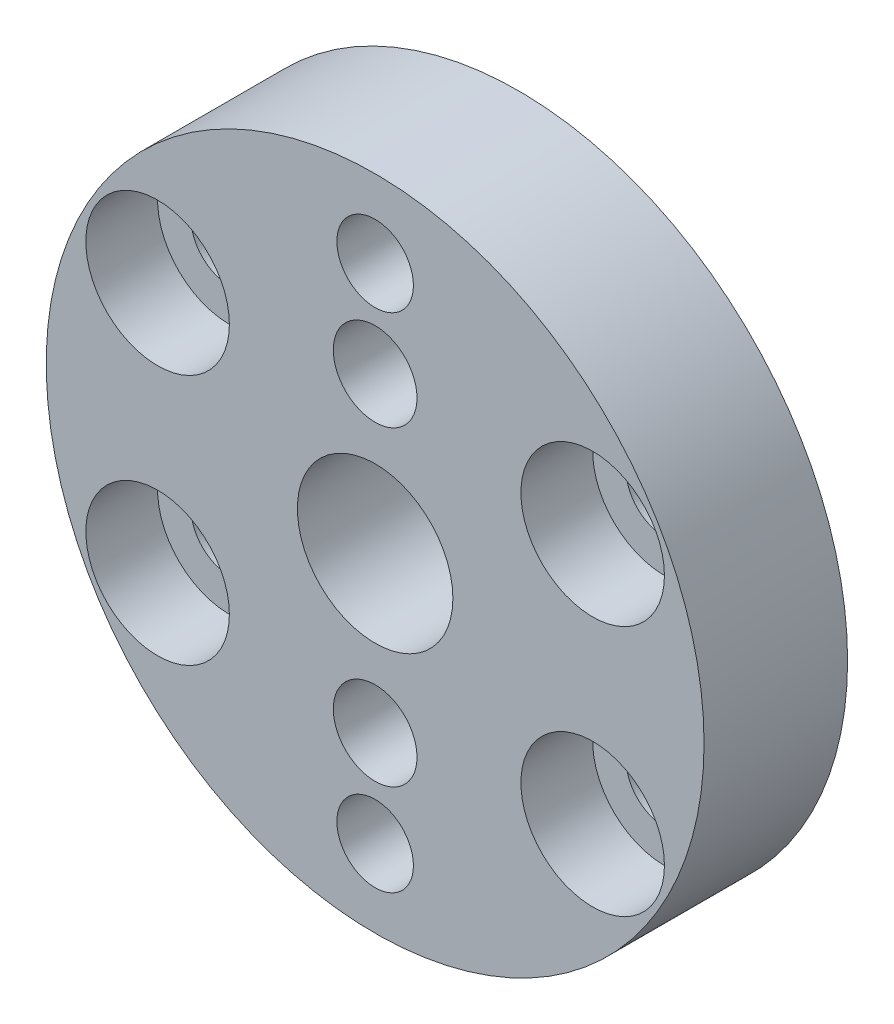
ISO-10303-21;
HEADER;
FILE_DESCRIPTION(('STEP AP214'),'2;1');
FILE_NAME('part.step','',(''),(''),'','','');
FILE_SCHEMA(('AUTOMOTIVE_DESIGN { 1 0 10303 214 1 1 1 1 }'));
ENDSEC;
DATA;
#1=APPLICATION_CONTEXT('core data for automotive mechanical design processes');
#2=APPLICATION_PROTOCOL_DEFINITION('international standard','automotive_design',2000,#1);
#3=PRODUCT_CONTEXT('',#1,'mechanical');
#4=PRODUCT('Part','Part','',(#3));
#5=PRODUCT_RELATED_PRODUCT_CATEGORY('part','',(#4));
#6=PRODUCT_DEFINITION_FORMATION('','',#4);
#7=PRODUCT_DEFINITION_CONTEXT('part definition',#1,'design');
#8=PRODUCT_DEFINITION('design','',#6,#7);
#9=PRODUCT_DEFINITION_SHAPE('','',#8);
#10=(LENGTH_UNIT() NAMED_UNIT(*) SI_UNIT(.MILLI.,.METRE.));
#11=(NAMED_UNIT(*) PLANE_ANGLE_UNIT() SI_UNIT($,.RADIAN.));
#12=(NAMED_UNIT(*) SI_UNIT($,.STERADIAN.) SOLID_ANGLE_UNIT());
#13=UNCERTAINTY_MEASURE_WITH_UNIT(LENGTH_MEASURE(1.E-05),#10,'distance_accuracy_value','');
#14=(GEOMETRIC_REPRESENTATION_CONTEXT(3) GLOBAL_UNCERTAINTY_ASSIGNED_CONTEXT((#13)) GLOBAL_UNIT_ASSIGNED_CONTEXT((#10,
#11,#12)) REPRESENTATION_CONTEXT('',''));
#15=CARTESIAN_POINT('',(0.,0.,0.));
#16=DIRECTION('',(0.,0.,1.));
#17=DIRECTION('',(1.,0.,0.));
#18=AXIS2_PLACEMENT_3D('',#15,#16,#17);
#19=CARTESIAN_POINT('',(-1.39645239816133E-13,-6.49999999999982,0.));
#20=DIRECTION('',(0.,0.,1.));
#21=DIRECTION('',(1.,0.,0.));
#22=AXIS2_PLACEMENT_3D('',#19,#20,#21);
#23=CYLINDRICAL_SURFACE('',#22,1.75);
#24=CARTESIAN_POINT('',(-1.39645239816133E-13,-6.49999999999982,6.));
#25=DIRECTION('',(0.,0.,1.));
#26=DIRECTION('',(1.,0.,0.));
#27=AXIS2_PLACEMENT_3D('',#24,#25,#26);
#28=CIRCLE('',#27,1.75);
#29=CARTESIAN_POINT('',(1.74999999999986,-6.49999999999982,6.));
#30=VERTEX_POINT('',#29);
#31=EDGE_CURVE('E333',#30,#30,#28,.T.);
#32=ORIENTED_EDGE('',*,*,#31,.T.);
#33=EDGE_LOOP('',(#32));
#34=FACE_BOUND('',#33,.T.);
#35=CARTESIAN_POINT('',(-1.39645239816133E-13,-6.49999999999982,3.));
#36=DIRECTION('',(0.,0.,-1.));
#37=DIRECTION('',(-1.,0.,0.));
#38=AXIS2_PLACEMENT_3D('',#35,#36,#37);
#39=CIRCLE('',#38,1.75);
#40=CARTESIAN_POINT('',(-1.75000000000014,-6.49999999999982,3.));
#41=VERTEX_POINT('',#40);
#42=EDGE_CURVE('E290',#41,#41,#39,.F.);
#43=ORIENTED_EDGE('',*,*,#42,.F.);
#44=EDGE_LOOP('',(#43));
#45=FACE_BOUND('',#44,.T.);
#46=ADVANCED_FACE('F43',(#34,#45),#23,.F.);
#47=CARTESIAN_POINT('',(0.,6.5,0.));
#48=DIRECTION('',(0.,0.,1.));
#49=DIRECTION('',(1.,0.,0.));
#50=AXIS2_PLACEMENT_3D('',#47,#48,#49);
#51=CYLINDRICAL_SURFACE('',#50,1.75);
#52=CARTESIAN_POINT('',(0.,6.5,6.));
#53=DIRECTION('',(0.,0.,1.));
#54=DIRECTION('',(1.,0.,0.));
#55=AXIS2_PLACEMENT_3D('',#52,#53,#54);
#56=CIRCLE('',#55,1.75);
#57=CARTESIAN_POINT('',(1.75000000000004,6.5,6.));
#58=VERTEX_POINT('',#57);
#59=EDGE_CURVE('E328',#58,#58,#56,.T.);
#60=ORIENTED_EDGE('',*,*,#59,.T.);
#61=EDGE_LOOP('',(#60));
#62=FACE_BOUND('',#61,.T.);
#63=CARTESIAN_POINT('',(0.,6.5,3.));
#64=DIRECTION('',(0.,0.,-1.));
#65=DIRECTION('',(-1.,0.,0.));
#66=AXIS2_PLACEMENT_3D('',#63,#64,#65);
#67=CIRCLE('',#66,1.75);
#68=CARTESIAN_POINT('',(-1.74999999999996,6.5,3.));
#69=VERTEX_POINT('',#68);
#70=EDGE_CURVE('E216',#69,#69,#67,.F.);
#71=ORIENTED_EDGE('',*,*,#70,.F.);
#72=EDGE_LOOP('',(#71));
#73=FACE_BOUND('',#72,.T.);
#74=ADVANCED_FACE('F449',(#62,#73),#51,.F.);
#75=CARTESIAN_POINT('',(9.09326673973672,5.2500000000002,6.));
#76=DIRECTION('',(0.,0.,-1.));
#77=DIRECTION('',(-1.,0.,0.));
#78=AXIS2_PLACEMENT_3D('',#75,#76,#77);
#79=CYLINDRICAL_SURFACE('',#78,1.6);
#80=CARTESIAN_POINT('',(9.09326673973672,5.2500000000002,0.));
#81=DIRECTION('',(0.,0.,1.));
#82=DIRECTION('',(1.,0.,0.));
#83=AXIS2_PLACEMENT_3D('',#80,#81,#82);
#84=CIRCLE('',#83,1.6);
#85=CARTESIAN_POINT('',(10.6932667397367,5.2500000000002,0.));
#86=VERTEX_POINT('',#85);
#87=EDGE_CURVE('E357',#86,#86,#84,.T.);
#88=ORIENTED_EDGE('',*,*,#87,.F.);
#89=EDGE_LOOP('',(#88));
#90=FACE_BOUND('',#89,.T.);
#91=CARTESIAN_POINT('',(9.09326673973672,5.2500000000002,3.));
#92=DIRECTION('',(0.,0.,1.));
#93=DIRECTION('',(1.,0.,0.));
#94=AXIS2_PLACEMENT_3D('',#91,#92,#93);
#95=CIRCLE('',#94,1.6);
#96=CARTESIAN_POINT('',(10.6932667397367,5.2500000000002,3.));
#97=VERTEX_POINT('',#96);
#98=EDGE_CURVE('E337',#97,#97,#95,.T.);
#99=ORIENTED_EDGE('',*,*,#98,.T.);
#100=EDGE_LOOP('',(#99));
#101=FACE_BOUND('',#100,.T.);
#102=ADVANCED_FACE('F455',(#90,#101),#79,.F.);
#103=CARTESIAN_POINT('',(9.09326673973694,-5.24999999999981,6.));
#104=DIRECTION('',(0.,0.,-1.));
#105=DIRECTION('',(-1.,0.,0.));
#106=AXIS2_PLACEMENT_3D('',#103,#104,#105);
#107=CYLINDRICAL_SURFACE('',#106,1.6);
#108=CARTESIAN_POINT('',(9.09326673973694,-5.24999999999981,0.));
#109=DIRECTION('',(0.,0.,1.));
#110=DIRECTION('',(1.,0.,0.));
#111=AXIS2_PLACEMENT_3D('',#108,#109,#110);
#112=CIRCLE('',#111,1.6);
#113=CARTESIAN_POINT('',(10.6932667397369,-5.24999999999981,0.));
#114=VERTEX_POINT('',#113);
#115=EDGE_CURVE('E350',#114,#114,#112,.T.);
#116=ORIENTED_EDGE('',*,*,#115,.F.);
#117=EDGE_LOOP('',(#116));
#118=FACE_BOUND('',#117,.T.);
#119=CARTESIAN_POINT('',(9.09326673973694,-5.24999999999981,3.));
#120=DIRECTION('',(0.,0.,1.));
#121=DIRECTION('',(1.,0.,0.));
#122=AXIS2_PLACEMENT_3D('',#119,#120,#121);
#123=CIRCLE('',#122,1.6);
#124=CARTESIAN_POINT('',(10.6932667397369,-5.24999999999981,3.));
#125=VERTEX_POINT('',#124);
#126=EDGE_CURVE('E393',#125,#125,#123,.T.);
#127=ORIENTED_EDGE('',*,*,#126,.T.);
#128=EDGE_LOOP('',(#127));
#129=FACE_BOUND('',#128,.T.);
#130=ADVANCED_FACE('F469',(#118,#129),#107,.F.);
#131=CARTESIAN_POINT('',(-9.09326673973627,-5.2500000000002,6.));
#132=DIRECTION('',(0.,0.,-1.));
#133=DIRECTION('',(-1.,0.,0.));
#134=AXIS2_PLACEMENT_3D('',#131,#132,#133);
#135=CYLINDRICAL_SURFACE('',#134,1.6);
#136=CARTESIAN_POINT('',(-9.09326673973627,-5.2500000000002,0.));
#137=DIRECTION('',(0.,0.,1.));
#138=DIRECTION('',(1.,0.,0.));
#139=AXIS2_PLACEMENT_3D('',#136,#137,#138);
#140=CIRCLE('',#139,1.6);
#141=CARTESIAN_POINT('',(-7.49326673973627,-5.2500000000002,0.));
#142=VERTEX_POINT('',#141);
#143=EDGE_CURVE('E341',#142,#142,#140,.T.);
#144=ORIENTED_EDGE('',*,*,#143,.F.);
#145=EDGE_LOOP('',(#144));
#146=FACE_BOUND('',#145,.T.);
#147=CARTESIAN_POINT('',(-9.09326673973627,-5.2500000000002,3.));
#148=DIRECTION('',(0.,0.,1.));
#149=DIRECTION('',(1.,0.,0.));
#150=AXIS2_PLACEMENT_3D('',#147,#148,#149);
#151=CIRCLE('',#150,1.6);
#152=CARTESIAN_POINT('',(-7.49326673973627,-5.2500000000002,3.));
#153=VERTEX_POINT('',#152);
#154=EDGE_CURVE('E389',#153,#153,#151,.T.);
#155=ORIENTED_EDGE('',*,*,#154,.T.);
#156=EDGE_LOOP('',(#155));
#157=FACE_BOUND('',#156,.T.);
#158=ADVANCED_FACE('F465',(#146,#157),#135,.F.);
#159=CARTESIAN_POINT('',(-9.0932667397365,5.2499999999998,6.));
#160=DIRECTION('',(0.,0.,-1.));
#161=DIRECTION('',(-1.,0.,0.));
#162=AXIS2_PLACEMENT_3D('',#159,#160,#161);
#163=CYLINDRICAL_SURFACE('',#162,1.6);
#164=CARTESIAN_POINT('',(-9.0932667397365,5.2499999999998,0.));
#165=DIRECTION('',(0.,0.,1.));
#166=DIRECTION('',(1.,0.,0.));
#167=AXIS2_PLACEMENT_3D('',#164,#165,#166);
#168=CIRCLE('',#167,1.6);
#169=CARTESIAN_POINT('',(-7.4932667397365,5.2499999999998,0.));
#170=VERTEX_POINT('',#169);
#171=EDGE_CURVE('E332',#170,#170,#168,.T.);
#172=ORIENTED_EDGE('',*,*,#171,.F.);
#173=EDGE_LOOP('',(#172));
#174=FACE_BOUND('',#173,.T.);
#175=CARTESIAN_POINT('',(-9.0932667397365,5.2499999999998,3.));
#176=DIRECTION('',(0.,0.,1.));
#177=DIRECTION('',(1.,0.,0.));
#178=AXIS2_PLACEMENT_3D('',#175,#176,#177);
#179=CIRCLE('',#178,1.6);
#180=CARTESIAN_POINT('',(-7.4932667397365,5.2499999999998,3.));
#181=VERTEX_POINT('',#180);
#182=EDGE_CURVE('E324',#181,#181,#179,.T.);
#183=ORIENTED_EDGE('',*,*,#182,.T.);
#184=EDGE_LOOP('',(#183));
#185=FACE_BOUND('',#184,.T.);
#186=ADVANCED_FACE('F461',(#174,#185),#163,.F.);
#187=CARTESIAN_POINT('',(0.,0.,6.));
#188=DIRECTION('',(0.,0.,1.));
#189=DIRECTION('',(1.,0.,0.));
#190=AXIS2_PLACEMENT_3D('',#187,#188,#189);
#191=PLANE('',#190);
#192=CARTESIAN_POINT('',(9.09326673973694,-5.24999999999981,6.));
#193=DIRECTION('',(0.,0.,1.));
#194=DIRECTION('',(1.,0.,0.));
#195=AXIS2_PLACEMENT_3D('',#192,#193,#194);
#196=CIRCLE('',#195,3.);
#197=CARTESIAN_POINT('',(12.0932667397369,-5.24999999999981,6.));
#198=VERTEX_POINT('',#197);
#199=EDGE_CURVE('E313',#198,#198,#196,.T.);
#200=ORIENTED_EDGE('',*,*,#199,.F.);
#201=EDGE_LOOP('',(#200));
#202=FACE_BOUND('',#201,.T.);
#203=CARTESIAN_POINT('',(-9.0932667397365,5.2499999999998,6.));
#204=DIRECTION('',(0.,0.,1.));
#205=DIRECTION('',(1.,0.,0.));
#206=AXIS2_PLACEMENT_3D('',#203,#204,#205);
#207=CIRCLE('',#206,3.);
#208=CARTESIAN_POINT('',(-6.0932667397365,5.2499999999998,6.));
#209=VERTEX_POINT('',#208);
#210=EDGE_CURVE('E305',#209,#209,#207,.T.);
#211=ORIENTED_EDGE('',*,*,#210,.F.);
#212=EDGE_LOOP('',(#211));
#213=FACE_BOUND('',#212,.T.);
#214=CARTESIAN_POINT('',(-9.09326673973627,-5.2500000000002,6.));
#215=DIRECTION('',(0.,0.,1.));
#216=DIRECTION('',(1.,0.,0.));
#217=AXIS2_PLACEMENT_3D('',#214,#215,#216);
#218=CIRCLE('',#217,3.);
#219=CARTESIAN_POINT('',(-6.09326673973627,-5.2500000000002,6.));
#220=VERTEX_POINT('',#219);
#221=EDGE_CURVE('E296',#220,#220,#218,.T.);
#222=ORIENTED_EDGE('',*,*,#221,.F.);
#223=EDGE_LOOP('',(#222));
#224=FACE_BOUND('',#223,.T.);
#225=CARTESIAN_POINT('',(9.09326673973672,5.2500000000002,6.));
#226=DIRECTION('',(0.,0.,1.));
#227=DIRECTION('',(1.,0.,0.));
#228=AXIS2_PLACEMENT_3D('',#225,#226,#227);
#229=CIRCLE('',#228,3.);
#230=CARTESIAN_POINT('',(12.0932667397367,5.2500000000002,6.));
#231=VERTEX_POINT('',#230);
#232=EDGE_CURVE('E300',#231,#231,#229,.T.);
#233=ORIENTED_EDGE('',*,*,#232,.F.);
#234=EDGE_LOOP('',(#233));
#235=FACE_BOUND('',#234,.T.);
#236=ORIENTED_EDGE('',*,*,#59,.F.);
#237=EDGE_LOOP('',(#236));
#238=FACE_BOUND('',#237,.T.);
#239=ORIENTED_EDGE('',*,*,#31,.F.);
#240=EDGE_LOOP('',(#239));
#241=FACE_BOUND('',#240,.T.);
#242=CARTESIAN_POINT('',(0.,0.,6.));
#243=DIRECTION('',(0.,0.,1.));
#244=DIRECTION('',(1.,0.,0.));
#245=AXIS2_PLACEMENT_3D('',#242,#243,#244);
#246=CIRCLE('',#245,3.25);
#247=CARTESIAN_POINT('',(3.25,0.,6.));
#248=VERTEX_POINT('',#247);
#249=EDGE_CURVE('E362',#248,#248,#246,.T.);
#250=ORIENTED_EDGE('',*,*,#249,.F.);
#251=EDGE_LOOP('',(#250));
#252=FACE_BOUND('',#251,.T.);
#253=CARTESIAN_POINT('',(0.,0.,6.));
#254=DIRECTION('',(0.,0.,1.));
#255=DIRECTION('',(1.,0.,0.));
#256=AXIS2_PLACEMENT_3D('',#253,#254,#255);
#257=CIRCLE('',#256,13.75);
#258=CARTESIAN_POINT('',(13.75,0.,6.));
#259=VERTEX_POINT('',#258);
#260=EDGE_CURVE('E378',#259,#259,#257,.T.);
#261=ORIENTED_EDGE('',*,*,#260,.T.);
#262=EDGE_LOOP('',(#261));
#263=FACE_BOUND('',#262,.T.);
#264=CARTESIAN_POINT('',(0.,10.5,6.));
#265=DIRECTION('',(0.,0.,1.));
#266=DIRECTION('',(1.,0.,0.));
#267=AXIS2_PLACEMENT_3D('',#264,#265,#266);
#268=CIRCLE('',#267,1.6);
#269=CARTESIAN_POINT('',(1.6,10.5,6.));
#270=VERTEX_POINT('',#269);
#271=EDGE_CURVE('E370',#270,#270,#268,.T.);
#272=ORIENTED_EDGE('',*,*,#271,.F.);
#273=EDGE_LOOP('',(#272));
#274=FACE_BOUND('',#273,.T.);
#275=CARTESIAN_POINT('',(4.46356044389758E-13,-10.5,6.));
#276=DIRECTION('',(0.,0.,1.));
#277=DIRECTION('',(1.,0.,0.));
#278=AXIS2_PLACEMENT_3D('',#275,#276,#277);
#279=CIRCLE('',#278,1.6);
#280=CARTESIAN_POINT('',(1.60000000000045,-10.5,6.));
#281=VERTEX_POINT('',#280);
#282=EDGE_CURVE('E346',#281,#281,#279,.T.);
#283=ORIENTED_EDGE('',*,*,#282,.F.);
#284=EDGE_LOOP('',(#283));
#285=FACE_BOUND('',#284,.T.);
#286=ADVANCED_FACE('F464',(#202,#213,#224,#235,#238,#241,#252,#263,#274,#285),#191,.T.);
#287=CARTESIAN_POINT('',(0.,0.,0.));
#288=DIRECTION('',(0.,0.,1.));
#289=DIRECTION('',(1.,0.,0.));
#290=AXIS2_PLACEMENT_3D('',#287,#288,#289);
#291=PLANE('',#290);
#292=CARTESIAN_POINT('',(0.,0.,0.));
#293=DIRECTION('',(0.,0.,1.));
#294=DIRECTION('',(1.,0.,0.));
#295=AXIS2_PLACEMENT_3D('',#292,#293,#294);
#296=CIRCLE('',#295,13.75);
#297=CARTESIAN_POINT('',(13.75,0.,0.));
#298=VERTEX_POINT('',#297);
#299=EDGE_CURVE('E374',#298,#298,#296,.T.);
#300=ORIENTED_EDGE('',*,*,#299,.F.);
#301=EDGE_LOOP('',(#300));
#302=FACE_BOUND('',#301,.T.);
#303=DIRECTION('',(0.494012576307102,-0.869454756988781,0.));
#304=VECTOR('',#303,1.);
#305=CARTESIAN_POINT('',(1.75270938922449,9.48797754290832,0.));
#306=LINE('',#305,#304);
#307=CARTESIAN_POINT('',(1.75270938922449,9.48797754290832,0.));
#308=VERTEX_POINT('',#307);
#309=CARTESIAN_POINT('',(3.46401915270828,6.47609791493428,0.));
#310=VERTEX_POINT('',#309);
#311=EDGE_CURVE('E183',#308,#310,#306,.T.);
#312=ORIENTED_EDGE('',*,*,#311,.F.);
#313=DIRECTION('',(0.999976195147061,-0.0068999376234412,0.));
#314=VECTOR('',#313,1.);
#315=CARTESIAN_POINT('',(-1.71130976348375,9.51187962797404,0.));
#316=LINE('',#315,#314);
#317=CARTESIAN_POINT('',(1.24214681558494,9.49150047668222,0.));
#318=VERTEX_POINT('',#317);
#319=EDGE_CURVE('E206',#318,#308,#316,.T.);
#320=ORIENTED_EDGE('',*,*,#319,.F.);
#321=CARTESIAN_POINT('',(0.,10.5,0.));
#322=DIRECTION('',(0.,0.,1.));
#323=DIRECTION('',(1.,0.,0.));
#324=AXIS2_PLACEMENT_3D('',#321,#322,#323);
#325=CIRCLE('',#324,1.6);
#326=CARTESIAN_POINT('',(-1.25594537681582,9.5087375673138,0.));
#327=VERTEX_POINT('',#326);
#328=EDGE_CURVE('E366',#318,#327,#325,.T.);
#329=ORIENTED_EDGE('',*,*,#328,.T.);
#330=CARTESIAN_POINT('',(-1.71130976348375,9.51187962797404,0.));
#331=VERTEX_POINT('',#330);
#332=EDGE_CURVE('E207',#331,#327,#316,.T.);
#333=ORIENTED_EDGE('',*,*,#332,.F.);
#334=DIRECTION('',(0.505963618839959,0.862554819365339,0.));
#335=VECTOR('',#334,1.);
#336=CARTESIAN_POINT('',(-3.46401915270819,6.52390208506571,0.));
#337=LINE('',#336,#335);
#338=CARTESIAN_POINT('',(-3.46401915270819,6.52390208506571,0.));
#339=VERTEX_POINT('',#338);
#340=EDGE_CURVE('E202',#339,#331,#337,.T.);
#341=ORIENTED_EDGE('',*,*,#340,.F.);
#342=DIRECTION('',(-0.494012576307102,0.869454756988781,0.));
#343=VECTOR('',#342,1.);
#344=CARTESIAN_POINT('',(-1.7527093892244,3.51202245709167,0.));
#345=LINE('',#344,#343);
#346=CARTESIAN_POINT('',(-1.7527093892244,3.51202245709167,0.));
#347=VERTEX_POINT('',#346);
#348=EDGE_CURVE('E198',#347,#339,#345,.T.);
#349=ORIENTED_EDGE('',*,*,#348,.F.);
#350=DIRECTION('',(-0.999976195147061,0.00689993762344183,0.));
#351=VECTOR('',#350,1.);
#352=CARTESIAN_POINT('',(1.71130976348384,3.48812037202596,0.));
#353=LINE('',#352,#351);
#354=CARTESIAN_POINT('',(1.71130976348384,3.48812037202596,0.));
#355=VERTEX_POINT('',#354);
#356=EDGE_CURVE('E159',#355,#347,#353,.T.);
#357=ORIENTED_EDGE('',*,*,#356,.F.);
#358=DIRECTION('',(-0.505963618839959,-0.862554819365339,0.));
#359=VECTOR('',#358,1.);
#360=CARTESIAN_POINT('',(3.46401915270828,6.47609791493428,0.));
#361=LINE('',#360,#359);
#362=EDGE_CURVE('E179',#310,#355,#361,.T.);
#363=ORIENTED_EDGE('',*,*,#362,.F.);
#364=EDGE_LOOP('',(#312,#320,#329,#333,#341,#349,#357,#363));
#365=FACE_BOUND('',#364,.T.);
#366=CARTESIAN_POINT('',(0.,0.,0.));
#367=DIRECTION('',(0.,0.,1.));
#368=DIRECTION('',(1.,0.,0.));
#369=AXIS2_PLACEMENT_3D('',#366,#367,#368);
#370=CIRCLE('',#369,3.25);
#371=CARTESIAN_POINT('',(3.25,0.,0.));
#372=VERTEX_POINT('',#371);
#373=EDGE_CURVE('E361',#372,#372,#370,.T.);
#374=ORIENTED_EDGE('',*,*,#373,.T.);
#375=EDGE_LOOP('',(#374));
#376=FACE_BOUND('',#375,.T.);
#377=ORIENTED_EDGE('',*,*,#87,.T.);
#378=EDGE_LOOP('',(#377));
#379=FACE_BOUND('',#378,.T.);
#380=ORIENTED_EDGE('',*,*,#115,.T.);
#381=EDGE_LOOP('',(#380));
#382=FACE_BOUND('',#381,.T.);
#383=DIRECTION('',(-0.302406249280172,0.953179133424719,0.));
#384=VECTOR('',#383,1.);
#385=CARTESIAN_POINT('',(-2.3357544119947,-9.05817343564642,0.));
#386=LINE('',#385,#384);
#387=CARTESIAN_POINT('',(-2.3357544119947,-9.05817343564642,0.));
#388=VERTEX_POINT('',#387);
#389=CARTESIAN_POINT('',(-3.38332038855389,-5.75626406003425,0.));
#390=VERTEX_POINT('',#389);
#391=EDGE_CURVE('E261',#388,#390,#386,.T.);
#392=ORIENTED_EDGE('',*,*,#391,.F.);
#393=DIRECTION('',(-0.97668046854313,0.214698072572561,0.));
#394=VECTOR('',#393,1.);
#395=CARTESIAN_POINT('',(1.04756597655906,-9.80190937561199,0.));
#396=LINE('',#395,#394);
#397=CARTESIAN_POINT('',(-1.09286440165038,-9.33139082683543,0.));
#398=VERTEX_POINT('',#397);
#399=EDGE_CURVE('E199',#398,#388,#396,.T.);
#400=ORIENTED_EDGE('',*,*,#399,.F.);
#401=CARTESIAN_POINT('',(4.46356044389758E-13,-10.5,0.));
#402=DIRECTION('',(0.,0.,1.));
#403=DIRECTION('',(1.,0.,0.));
#404=AXIS2_PLACEMENT_3D('',#401,#402,#403);
#405=CIRCLE('',#404,1.6);
#406=CARTESIAN_POINT('',(1.28301780376739,-9.54403696974357,0.));
#407=VERTEX_POINT('',#406);
#408=EDGE_CURVE('E345',#398,#407,#405,.T.);
#409=ORIENTED_EDGE('',*,*,#408,.T.);
#410=DIRECTION('',(-0.674274219262957,-0.738481060852158,0.));
#411=VECTOR('',#410,1.);
#412=CARTESIAN_POINT('',(3.38332038855361,-7.24373593996539,0.));
#413=LINE('',#412,#411);
#414=CARTESIAN_POINT('',(3.38332038855361,-7.24373593996539,0.));
#415=VERTEX_POINT('',#414);
#416=EDGE_CURVE('E245',#415,#407,#413,.T.);
#417=ORIENTED_EDGE('',*,*,#416,.F.);
#418=DIRECTION('',(0.302406249280172,-0.953179133424719,0.));
#419=VECTOR('',#418,1.);
#420=CARTESIAN_POINT('',(2.33575441199442,-3.94182656435321,0.));
#421=LINE('',#420,#419);
#422=CARTESIAN_POINT('',(2.33575441199442,-3.94182656435321,0.));
#423=VERTEX_POINT('',#422);
#424=EDGE_CURVE('E248',#423,#415,#421,.T.);
#425=ORIENTED_EDGE('',*,*,#424,.F.);
#426=DIRECTION('',(0.97668046854313,-0.214698072572561,0.));
#427=VECTOR('',#426,1.);
#428=CARTESIAN_POINT('',(-1.04756597655933,-3.19809062438764,0.));
#429=LINE('',#428,#427);
#430=CARTESIAN_POINT('',(-1.04756597655933,-3.19809062438764,0.));
#431=VERTEX_POINT('',#430);
#432=EDGE_CURVE('E253',#431,#423,#429,.T.);
#433=ORIENTED_EDGE('',*,*,#432,.F.);
#434=DIRECTION('',(0.674274219262958,0.738481060852158,0.));
#435=VECTOR('',#434,1.);
#436=CARTESIAN_POINT('',(-3.38332038855389,-5.75626406003425,0.));
#437=LINE('',#436,#435);
#438=EDGE_CURVE('E257',#390,#431,#437,.T.);
#439=ORIENTED_EDGE('',*,*,#438,.F.);
#440=EDGE_LOOP('',(#392,#400,#409,#417,#425,#433,#439));
#441=FACE_BOUND('',#440,.T.);
#442=ORIENTED_EDGE('',*,*,#143,.T.);
#443=EDGE_LOOP('',(#442));
#444=FACE_BOUND('',#443,.T.);
#445=ORIENTED_EDGE('',*,*,#171,.T.);
#446=EDGE_LOOP('',(#445));
#447=FACE_BOUND('',#446,.T.);
#448=ADVANCED_FACE('F434',(#302,#365,#376,#379,#382,#441,#444,#447),#291,.F.);
#449=CARTESIAN_POINT('',(0.,0.,6.));
#450=DIRECTION('',(0.,0.,-1.));
#451=DIRECTION('',(-1.,0.,0.));
#452=AXIS2_PLACEMENT_3D('',#449,#450,#451);
#453=CYLINDRICAL_SURFACE('',#452,13.75);
#454=ORIENTED_EDGE('',*,*,#260,.F.);
#455=EDGE_LOOP('',(#454));
#456=FACE_BOUND('',#455,.T.);
#457=ORIENTED_EDGE('',*,*,#299,.T.);
#458=EDGE_LOOP('',(#457));
#459=FACE_BOUND('',#458,.T.);
#460=ADVANCED_FACE('F45',(#456,#459),#453,.T.);
#461=CARTESIAN_POINT('',(0.,10.5,6.));
#462=DIRECTION('',(0.,0.,-1.));
#463=DIRECTION('',(-1.,0.,0.));
#464=AXIS2_PLACEMENT_3D('',#461,#462,#463);
#465=CYLINDRICAL_SURFACE('',#464,1.6);
#466=DIRECTION('',(0.,0.,-1.));
#467=VECTOR('',#466,1.);
#468=CARTESIAN_POINT('',(1.24214681558494,9.49150047668222,6.));
#469=LINE('',#468,#467);
#470=CARTESIAN_POINT('',(1.24214681558494,9.49150047668222,3.));
#471=VERTEX_POINT('',#470);
#472=EDGE_CURVE('E11',#471,#318,#469,.T.);
#473=ORIENTED_EDGE('',*,*,#472,.F.);
#474=CARTESIAN_POINT('',(0.,10.5,3.));
#475=DIRECTION('',(0.,0.,-1.));
#476=DIRECTION('',(-1.,0.,0.));
#477=AXIS2_PLACEMENT_3D('',#474,#475,#476);
#478=CIRCLE('',#477,1.6);
#479=CARTESIAN_POINT('',(-1.25594537681582,9.5087375673138,3.));
#480=VERTEX_POINT('',#479);
#481=EDGE_CURVE('E286',#471,#480,#478,.T.);
#482=ORIENTED_EDGE('',*,*,#481,.T.);
#483=DIRECTION('',(0.,0.,-1.));
#484=VECTOR('',#483,1.);
#485=CARTESIAN_POINT('',(-1.25594537681582,9.5087375673138,6.));
#486=LINE('',#485,#484);
#487=EDGE_CURVE('E52',#327,#480,#486,.F.);
#488=ORIENTED_EDGE('',*,*,#487,.F.);
#489=ORIENTED_EDGE('',*,*,#328,.F.);
#490=EDGE_LOOP('',(#473,#482,#488,#489));
#491=FACE_BOUND('',#490,.T.);
#492=ORIENTED_EDGE('',*,*,#271,.T.);
#493=EDGE_LOOP('',(#492));
#494=FACE_BOUND('',#493,.T.);
#495=ADVANCED_FACE('F418',(#491,#494),#465,.F.);
#496=CARTESIAN_POINT('',(0.,0.,6.));
#497=DIRECTION('',(0.,0.,-1.));
#498=DIRECTION('',(-1.,0.,0.));
#499=AXIS2_PLACEMENT_3D('',#496,#497,#498);
#500=CYLINDRICAL_SURFACE('',#499,3.25);
#501=ORIENTED_EDGE('',*,*,#249,.T.);
#502=EDGE_LOOP('',(#501));
#503=FACE_BOUND('',#502,.T.);
#504=ORIENTED_EDGE('',*,*,#373,.F.);
#505=EDGE_LOOP('',(#504));
#506=FACE_BOUND('',#505,.T.);
#507=ADVANCED_FACE('F475',(#503,#506),#500,.F.);
#508=CARTESIAN_POINT('',(4.46356044389758E-13,-10.5,6.));
#509=DIRECTION('',(0.,0.,-1.));
#510=DIRECTION('',(-1.,0.,0.));
#511=AXIS2_PLACEMENT_3D('',#508,#509,#510);
#512=CYLINDRICAL_SURFACE('',#511,1.6);
#513=DIRECTION('',(0.,0.,-1.));
#514=VECTOR('',#513,1.);
#515=CARTESIAN_POINT('',(-1.09286440165038,-9.33139082683543,6.));
#516=LINE('',#515,#514);
#517=CARTESIAN_POINT('',(-1.09286440165038,-9.33139082683543,3.));
#518=VERTEX_POINT('',#517);
#519=EDGE_CURVE('E408',#518,#398,#516,.T.);
#520=ORIENTED_EDGE('',*,*,#519,.F.);
#521=CARTESIAN_POINT('',(4.46356044389758E-13,-10.5,3.));
#522=DIRECTION('',(0.,0.,-1.));
#523=DIRECTION('',(-1.,0.,0.));
#524=AXIS2_PLACEMENT_3D('',#521,#522,#523);
#525=CIRCLE('',#524,1.6);
#526=CARTESIAN_POINT('',(1.28301780376739,-9.54403696974357,3.));
#527=VERTEX_POINT('',#526);
#528=EDGE_CURVE('E291',#518,#527,#525,.T.);
#529=ORIENTED_EDGE('',*,*,#528,.T.);
#530=DIRECTION('',(0.,0.,-1.));
#531=VECTOR('',#530,1.);
#532=CARTESIAN_POINT('',(1.28301780376739,-9.54403696974357,6.));
#533=LINE('',#532,#531);
#534=EDGE_CURVE('E382',#407,#527,#533,.F.);
#535=ORIENTED_EDGE('',*,*,#534,.F.);
#536=ORIENTED_EDGE('',*,*,#408,.F.);
#537=EDGE_LOOP('',(#520,#529,#535,#536));
#538=FACE_BOUND('',#537,.T.);
#539=ORIENTED_EDGE('',*,*,#282,.T.);
#540=EDGE_LOOP('',(#539));
#541=FACE_BOUND('',#540,.T.);
#542=ADVANCED_FACE('F471',(#538,#541),#512,.F.);
#543=CARTESIAN_POINT('',(-9.0932667397365,5.2499999999998,3.));
#544=DIRECTION('',(0.,0.,1.));
#545=DIRECTION('',(1.,0.,0.));
#546=AXIS2_PLACEMENT_3D('',#543,#544,#545);
#547=CYLINDRICAL_SURFACE('',#546,3.);
#548=CARTESIAN_POINT('',(-9.0932667397365,5.2499999999998,3.));
#549=DIRECTION('',(0.,0.,1.));
#550=DIRECTION('',(1.,0.,0.));
#551=AXIS2_PLACEMENT_3D('',#548,#549,#550);
#552=CIRCLE('',#551,3.);
#553=CARTESIAN_POINT('',(-6.0932667397365,5.2499999999998,3.));
#554=VERTEX_POINT('',#553);
#555=EDGE_CURVE('E309',#554,#554,#552,.T.);
#556=ORIENTED_EDGE('',*,*,#555,.F.);
#557=EDGE_LOOP('',(#556));
#558=FACE_BOUND('',#557,.T.);
#559=ORIENTED_EDGE('',*,*,#210,.T.);
#560=EDGE_LOOP('',(#559));
#561=FACE_BOUND('',#560,.T.);
#562=ADVANCED_FACE('F474',(#558,#561),#547,.F.);
#563=CARTESIAN_POINT('',(-9.0932667397365,5.2499999999998,3.));
#564=DIRECTION('',(0.,0.,1.));
#565=DIRECTION('',(1.,0.,0.));
#566=AXIS2_PLACEMENT_3D('',#563,#564,#565);
#567=PLANE('',#566);
#568=ORIENTED_EDGE('',*,*,#182,.F.);
#569=EDGE_LOOP('',(#568));
#570=FACE_BOUND('',#569,.T.);
#571=ORIENTED_EDGE('',*,*,#555,.T.);
#572=EDGE_LOOP('',(#571));
#573=FACE_BOUND('',#572,.T.);
#574=ADVANCED_FACE('F527',(#570,#573),#567,.T.);
#575=CARTESIAN_POINT('',(-9.09326673973627,-5.2500000000002,3.));
#576=DIRECTION('',(0.,0.,1.));
#577=DIRECTION('',(1.,0.,0.));
#578=AXIS2_PLACEMENT_3D('',#575,#576,#577);
#579=CYLINDRICAL_SURFACE('',#578,3.);
#580=CARTESIAN_POINT('',(-9.09326673973627,-5.2500000000002,3.));
#581=DIRECTION('',(0.,0.,1.));
#582=DIRECTION('',(1.,0.,0.));
#583=AXIS2_PLACEMENT_3D('',#580,#581,#582);
#584=CIRCLE('',#583,3.);
#585=CARTESIAN_POINT('',(-6.09326673973627,-5.2500000000002,3.));
#586=VERTEX_POINT('',#585);
#587=EDGE_CURVE('E301',#586,#586,#584,.T.);
#588=ORIENTED_EDGE('',*,*,#587,.F.);
#589=EDGE_LOOP('',(#588));
#590=FACE_BOUND('',#589,.T.);
#591=ORIENTED_EDGE('',*,*,#221,.T.);
#592=EDGE_LOOP('',(#591));
#593=FACE_BOUND('',#592,.T.);
#594=ADVANCED_FACE('F536',(#590,#593),#579,.F.);
#595=CARTESIAN_POINT('',(-9.09326673973627,-5.2500000000002,3.));
#596=DIRECTION('',(0.,0.,1.));
#597=DIRECTION('',(1.,0.,0.));
#598=AXIS2_PLACEMENT_3D('',#595,#596,#597);
#599=PLANE('',#598);
#600=ORIENTED_EDGE('',*,*,#154,.F.);
#601=EDGE_LOOP('',(#600));
#602=FACE_BOUND('',#601,.T.);
#603=ORIENTED_EDGE('',*,*,#587,.T.);
#604=EDGE_LOOP('',(#603));
#605=FACE_BOUND('',#604,.T.);
#606=ADVANCED_FACE('F544',(#602,#605),#599,.T.);
#607=CARTESIAN_POINT('',(9.09326673973694,-5.24999999999981,3.));
#608=DIRECTION('',(0.,0.,1.));
#609=DIRECTION('',(1.,0.,0.));
#610=AXIS2_PLACEMENT_3D('',#607,#608,#609);
#611=CYLINDRICAL_SURFACE('',#610,3.);
#612=CARTESIAN_POINT('',(9.09326673973694,-5.24999999999981,3.));
#613=DIRECTION('',(0.,0.,1.));
#614=DIRECTION('',(1.,0.,0.));
#615=AXIS2_PLACEMENT_3D('',#612,#613,#614);
#616=CIRCLE('',#615,3.);
#617=CARTESIAN_POINT('',(12.0932667397369,-5.24999999999981,3.));
#618=VERTEX_POINT('',#617);
#619=EDGE_CURVE('E295',#618,#618,#616,.T.);
#620=ORIENTED_EDGE('',*,*,#619,.F.);
#621=EDGE_LOOP('',(#620));
#622=FACE_BOUND('',#621,.T.);
#623=ORIENTED_EDGE('',*,*,#199,.T.);
#624=EDGE_LOOP('',(#623));
#625=FACE_BOUND('',#624,.T.);
#626=ADVANCED_FACE('F552',(#622,#625),#611,.F.);
#627=CARTESIAN_POINT('',(9.09326673973694,-5.24999999999981,3.));
#628=DIRECTION('',(0.,0.,1.));
#629=DIRECTION('',(1.,0.,0.));
#630=AXIS2_PLACEMENT_3D('',#627,#628,#629);
#631=PLANE('',#630);
#632=ORIENTED_EDGE('',*,*,#126,.F.);
#633=EDGE_LOOP('',(#632));
#634=FACE_BOUND('',#633,.T.);
#635=ORIENTED_EDGE('',*,*,#619,.T.);
#636=EDGE_LOOP('',(#635));
#637=FACE_BOUND('',#636,.T.);
#638=ADVANCED_FACE('F560',(#634,#637),#631,.T.);
#639=CARTESIAN_POINT('',(9.09326673973672,5.2500000000002,3.));
#640=DIRECTION('',(0.,0.,1.));
#641=DIRECTION('',(1.,0.,0.));
#642=AXIS2_PLACEMENT_3D('',#639,#640,#641);
#643=CYLINDRICAL_SURFACE('',#642,3.);
#644=CARTESIAN_POINT('',(9.09326673973672,5.2500000000002,3.));
#645=DIRECTION('',(0.,0.,1.));
#646=DIRECTION('',(1.,0.,0.));
#647=AXIS2_PLACEMENT_3D('',#644,#645,#646);
#648=CIRCLE('',#647,3.);
#649=CARTESIAN_POINT('',(12.0932667397367,5.2500000000002,3.));
#650=VERTEX_POINT('',#649);
#651=EDGE_CURVE('E320',#650,#650,#648,.T.);
#652=ORIENTED_EDGE('',*,*,#651,.F.);
#653=EDGE_LOOP('',(#652));
#654=FACE_BOUND('',#653,.T.);
#655=ORIENTED_EDGE('',*,*,#232,.T.);
#656=EDGE_LOOP('',(#655));
#657=FACE_BOUND('',#656,.T.);
#658=ADVANCED_FACE('F568',(#654,#657),#643,.F.);
#659=CARTESIAN_POINT('',(9.09326673973672,5.2500000000002,3.));
#660=DIRECTION('',(0.,0.,1.));
#661=DIRECTION('',(1.,0.,0.));
#662=AXIS2_PLACEMENT_3D('',#659,#660,#661);
#663=PLANE('',#662);
#664=ORIENTED_EDGE('',*,*,#98,.F.);
#665=EDGE_LOOP('',(#664));
#666=FACE_BOUND('',#665,.T.);
#667=ORIENTED_EDGE('',*,*,#651,.T.);
#668=EDGE_LOOP('',(#667));
#669=FACE_BOUND('',#668,.T.);
#670=ADVANCED_FACE('F576',(#666,#669),#663,.T.);
#671=CARTESIAN_POINT('',(-1.71130976348375,9.51187962797404,3.));
#672=DIRECTION('',(0.00689993762344119,0.999976195147061,0.));
#673=DIRECTION('',(-0.999976195147061,0.0068999376234412,0.));
#674=AXIS2_PLACEMENT_3D('',#671,#672,#673);
#675=PLANE('',#674);
#676=ORIENTED_EDGE('',*,*,#472,.T.);
#677=ORIENTED_EDGE('',*,*,#319,.T.);
#678=DIRECTION('',(0.,0.,-1.));
#679=VECTOR('',#678,1.);
#680=CARTESIAN_POINT('',(1.75270938922449,9.48797754290832,3.));
#681=LINE('',#680,#679);
#682=CARTESIAN_POINT('',(1.75270938922449,9.48797754290832,3.));
#683=VERTEX_POINT('',#682);
#684=EDGE_CURVE('E220',#683,#308,#681,.T.);
#685=ORIENTED_EDGE('',*,*,#684,.F.);
#686=DIRECTION('',(0.999976195147061,-0.0068999376234412,0.));
#687=VECTOR('',#686,1.);
#688=CARTESIAN_POINT('',(-1.71130976348375,9.51187962797404,3.));
#689=LINE('',#688,#687);
#690=EDGE_CURVE('E188',#471,#683,#689,.T.);
#691=ORIENTED_EDGE('',*,*,#690,.F.);
#692=EDGE_LOOP('',(#676,#677,#685,#691));
#693=FACE_BOUND('',#692,.T.);
#694=ADVANCED_FACE('F423',(#693),#675,.F.);
#695=CARTESIAN_POINT('',(0.,0.,3.));
#696=DIRECTION('',(0.,0.,-1.));
#697=DIRECTION('',(-1.,0.,0.));
#698=AXIS2_PLACEMENT_3D('',#695,#696,#697);
#699=PLANE('',#698);
#700=ORIENTED_EDGE('',*,*,#690,.T.);
#701=DIRECTION('',(0.494012576307102,-0.869454756988781,0.));
#702=VECTOR('',#701,1.);
#703=CARTESIAN_POINT('',(1.75270938922449,9.48797754290832,3.));
#704=LINE('',#703,#702);
#705=CARTESIAN_POINT('',(3.46401915270828,6.47609791493428,3.));
#706=VERTEX_POINT('',#705);
#707=EDGE_CURVE('E191',#683,#706,#704,.T.);
#708=ORIENTED_EDGE('',*,*,#707,.T.);
#709=DIRECTION('',(-0.505963618839959,-0.862554819365339,0.));
#710=VECTOR('',#709,1.);
#711=CARTESIAN_POINT('',(3.46401915270828,6.47609791493428,3.));
#712=LINE('',#711,#710);
#713=CARTESIAN_POINT('',(1.71130976348384,3.48812037202596,3.));
#714=VERTEX_POINT('',#713);
#715=EDGE_CURVE('E165',#706,#714,#712,.T.);
#716=ORIENTED_EDGE('',*,*,#715,.T.);
#717=DIRECTION('',(-0.999976195147061,0.00689993762344183,0.));
#718=VECTOR('',#717,1.);
#719=CARTESIAN_POINT('',(1.71130976348384,3.48812037202596,3.));
#720=LINE('',#719,#718);
#721=CARTESIAN_POINT('',(-1.7527093892244,3.51202245709167,3.));
#722=VERTEX_POINT('',#721);
#723=EDGE_CURVE('E156',#714,#722,#720,.T.);
#724=ORIENTED_EDGE('',*,*,#723,.T.);
#725=DIRECTION('',(-0.494012576307102,0.869454756988781,0.));
#726=VECTOR('',#725,1.);
#727=CARTESIAN_POINT('',(-1.7527093892244,3.51202245709167,3.));
#728=LINE('',#727,#726);
#729=CARTESIAN_POINT('',(-3.46401915270819,6.52390208506571,3.));
#730=VERTEX_POINT('',#729);
#731=EDGE_CURVE('E168',#722,#730,#728,.T.);
#732=ORIENTED_EDGE('',*,*,#731,.T.);
#733=DIRECTION('',(0.505963618839959,0.862554819365339,0.));
#734=VECTOR('',#733,1.);
#735=CARTESIAN_POINT('',(-3.46401915270819,6.52390208506571,3.));
#736=LINE('',#735,#734);
#737=CARTESIAN_POINT('',(-1.71130976348375,9.51187962797404,3.));
#738=VERTEX_POINT('',#737);
#739=EDGE_CURVE('E172',#730,#738,#736,.T.);
#740=ORIENTED_EDGE('',*,*,#739,.T.);
#741=EDGE_CURVE('E59',#738,#480,#689,.T.);
#742=ORIENTED_EDGE('',*,*,#741,.T.);
#743=ORIENTED_EDGE('',*,*,#481,.F.);
#744=EDGE_LOOP('',(#700,#708,#716,#724,#732,#740,#742,#743));
#745=FACE_BOUND('',#744,.T.);
#746=ORIENTED_EDGE('',*,*,#70,.T.);
#747=EDGE_LOOP('',(#746));
#748=FACE_BOUND('',#747,.T.);
#749=ADVANCED_FACE('F174',(#745,#748),#699,.T.);
#750=CARTESIAN_POINT('',(1.71130976348384,3.48812037202596,3.));
#751=DIRECTION('',(-0.00689993762344183,-0.999976195147061,0.));
#752=DIRECTION('',(0.999976195147061,-0.00689993762344183,0.));
#753=AXIS2_PLACEMENT_3D('',#750,#751,#752);
#754=PLANE('',#753);
#755=ORIENTED_EDGE('',*,*,#356,.T.);
#756=DIRECTION('',(0.,0.,-1.));
#757=VECTOR('',#756,1.);
#758=CARTESIAN_POINT('',(-1.7527093892244,3.51202245709167,3.));
#759=LINE('',#758,#757);
#760=EDGE_CURVE('E152',#722,#347,#759,.T.);
#761=ORIENTED_EDGE('',*,*,#760,.F.);
#762=ORIENTED_EDGE('',*,*,#723,.F.);
#763=DIRECTION('',(0.,0.,-1.));
#764=VECTOR('',#763,1.);
#765=CARTESIAN_POINT('',(1.71130976348384,3.48812037202596,3.));
#766=LINE('',#765,#764);
#767=EDGE_CURVE('E213',#714,#355,#766,.T.);
#768=ORIENTED_EDGE('',*,*,#767,.T.);
#769=EDGE_LOOP('',(#755,#761,#762,#768));
#770=FACE_BOUND('',#769,.T.);
#771=ADVANCED_FACE('F154',(#770),#754,.F.);
#772=CARTESIAN_POINT('',(3.46401915270828,6.47609791493428,3.));
#773=DIRECTION('',(0.862554819365339,-0.505963618839959,0.));
#774=DIRECTION('',(0.505963618839959,0.862554819365339,0.));
#775=AXIS2_PLACEMENT_3D('',#772,#773,#774);
#776=PLANE('',#775);
#777=ORIENTED_EDGE('',*,*,#362,.T.);
#778=ORIENTED_EDGE('',*,*,#767,.F.);
#779=ORIENTED_EDGE('',*,*,#715,.F.);
#780=DIRECTION('',(0.,0.,-1.));
#781=VECTOR('',#780,1.);
#782=CARTESIAN_POINT('',(3.46401915270828,6.47609791493428,3.));
#783=LINE('',#782,#781);
#784=EDGE_CURVE('E217',#706,#310,#783,.T.);
#785=ORIENTED_EDGE('',*,*,#784,.T.);
#786=EDGE_LOOP('',(#777,#778,#779,#785));
#787=FACE_BOUND('',#786,.T.);
#788=ADVANCED_FACE('F431',(#787),#776,.F.);
#789=CARTESIAN_POINT('',(1.75270938922449,9.48797754290832,3.));
#790=DIRECTION('',(0.869454756988781,0.494012576307102,0.));
#791=DIRECTION('',(-0.494012576307102,0.869454756988781,0.));
#792=AXIS2_PLACEMENT_3D('',#789,#790,#791);
#793=PLANE('',#792);
#794=ORIENTED_EDGE('',*,*,#311,.T.);
#795=ORIENTED_EDGE('',*,*,#784,.F.);
#796=ORIENTED_EDGE('',*,*,#707,.F.);
#797=ORIENTED_EDGE('',*,*,#684,.T.);
#798=EDGE_LOOP('',(#794,#795,#796,#797));
#799=FACE_BOUND('',#798,.T.);
#800=ADVANCED_FACE('F429',(#799),#793,.F.);
#801=ORIENTED_EDGE('',*,*,#487,.T.);
#802=ORIENTED_EDGE('',*,*,#741,.F.);
#803=DIRECTION('',(0.,0.,-1.));
#804=VECTOR('',#803,1.);
#805=CARTESIAN_POINT('',(-1.71130976348375,9.51187962797404,3.));
#806=LINE('',#805,#804);
#807=EDGE_CURVE('E224',#738,#331,#806,.T.);
#808=ORIENTED_EDGE('',*,*,#807,.T.);
#809=ORIENTED_EDGE('',*,*,#332,.T.);
#810=EDGE_LOOP('',(#801,#802,#808,#809));
#811=FACE_BOUND('',#810,.T.);
#812=ADVANCED_FACE('F413',(#811),#675,.F.);
#813=CARTESIAN_POINT('',(-3.46401915270819,6.52390208506571,3.));
#814=DIRECTION('',(-0.862554819365339,0.505963618839959,0.));
#815=DIRECTION('',(-0.505963618839959,-0.862554819365339,0.));
#816=AXIS2_PLACEMENT_3D('',#813,#814,#815);
#817=PLANE('',#816);
#818=ORIENTED_EDGE('',*,*,#340,.T.);
#819=ORIENTED_EDGE('',*,*,#807,.F.);
#820=ORIENTED_EDGE('',*,*,#739,.F.);
#821=DIRECTION('',(0.,0.,-1.));
#822=VECTOR('',#821,1.);
#823=CARTESIAN_POINT('',(-3.46401915270819,6.52390208506571,3.));
#824=LINE('',#823,#822);
#825=EDGE_CURVE('E164',#730,#339,#824,.T.);
#826=ORIENTED_EDGE('',*,*,#825,.T.);
#827=EDGE_LOOP('',(#818,#819,#820,#826));
#828=FACE_BOUND('',#827,.T.);
#829=ADVANCED_FACE('F438',(#828),#817,.F.);
#830=CARTESIAN_POINT('',(-1.7527093892244,3.51202245709167,3.));
#831=DIRECTION('',(-0.869454756988781,-0.494012576307102,0.));
#832=DIRECTION('',(0.494012576307102,-0.869454756988781,0.));
#833=AXIS2_PLACEMENT_3D('',#830,#831,#832);
#834=PLANE('',#833);
#835=ORIENTED_EDGE('',*,*,#348,.T.);
#836=ORIENTED_EDGE('',*,*,#825,.F.);
#837=ORIENTED_EDGE('',*,*,#731,.F.);
#838=ORIENTED_EDGE('',*,*,#760,.T.);
#839=EDGE_LOOP('',(#835,#836,#837,#838));
#840=FACE_BOUND('',#839,.T.);
#841=ADVANCED_FACE('F169',(#840),#834,.F.);
#842=CARTESIAN_POINT('',(0.,0.,3.));
#843=DIRECTION('',(0.,0.,-1.));
#844=DIRECTION('',(-1.,0.,0.));
#845=AXIS2_PLACEMENT_3D('',#842,#843,#844);
#846=PLANE('',#845);
#847=DIRECTION('',(-0.97668046854313,0.214698072572561,0.));
#848=VECTOR('',#847,1.);
#849=CARTESIAN_POINT('',(1.04756597655906,-9.80190937561199,3.));
#850=LINE('',#849,#848);
#851=CARTESIAN_POINT('',(-2.3357544119947,-9.05817343564642,3.));
#852=VERTEX_POINT('',#851);
#853=EDGE_CURVE('E249',#518,#852,#850,.T.);
#854=ORIENTED_EDGE('',*,*,#853,.T.);
#855=DIRECTION('',(-0.302406249280172,0.953179133424719,0.));
#856=VECTOR('',#855,1.);
#857=CARTESIAN_POINT('',(-2.3357544119947,-9.05817343564642,3.));
#858=LINE('',#857,#856);
#859=CARTESIAN_POINT('',(-3.38332038855389,-5.75626406003425,3.));
#860=VERTEX_POINT('',#859);
#861=EDGE_CURVE('E280',#852,#860,#858,.T.);
#862=ORIENTED_EDGE('',*,*,#861,.T.);
#863=DIRECTION('',(0.674274219262958,0.738481060852158,0.));
#864=VECTOR('',#863,1.);
#865=CARTESIAN_POINT('',(-3.38332038855389,-5.75626406003425,3.));
#866=LINE('',#865,#864);
#867=CARTESIAN_POINT('',(-1.04756597655933,-3.19809062438764,3.));
#868=VERTEX_POINT('',#867);
#869=EDGE_CURVE('E276',#860,#868,#866,.T.);
#870=ORIENTED_EDGE('',*,*,#869,.T.);
#871=DIRECTION('',(0.97668046854313,-0.214698072572561,0.));
#872=VECTOR('',#871,1.);
#873=CARTESIAN_POINT('',(-1.04756597655933,-3.19809062438764,3.));
#874=LINE('',#873,#872);
#875=CARTESIAN_POINT('',(2.33575441199442,-3.94182656435321,3.));
#876=VERTEX_POINT('',#875);
#877=EDGE_CURVE('E272',#868,#876,#874,.T.);
#878=ORIENTED_EDGE('',*,*,#877,.T.);
#879=DIRECTION('',(0.302406249280172,-0.953179133424719,0.));
#880=VECTOR('',#879,1.);
#881=CARTESIAN_POINT('',(2.33575441199442,-3.94182656435321,3.));
#882=LINE('',#881,#880);
#883=CARTESIAN_POINT('',(3.38332038855361,-7.24373593996539,3.));
#884=VERTEX_POINT('',#883);
#885=EDGE_CURVE('E269',#876,#884,#882,.T.);
#886=ORIENTED_EDGE('',*,*,#885,.T.);
#887=DIRECTION('',(-0.674274219262957,-0.738481060852158,0.));
#888=VECTOR('',#887,1.);
#889=CARTESIAN_POINT('',(3.38332038855361,-7.24373593996539,3.));
#890=LINE('',#889,#888);
#891=EDGE_CURVE('E67',#884,#527,#890,.T.);
#892=ORIENTED_EDGE('',*,*,#891,.T.);
#893=ORIENTED_EDGE('',*,*,#528,.F.);
#894=EDGE_LOOP('',(#854,#862,#870,#878,#886,#892,#893));
#895=FACE_BOUND('',#894,.T.);
#896=ORIENTED_EDGE('',*,*,#42,.T.);
#897=EDGE_LOOP('',(#896));
#898=FACE_BOUND('',#897,.T.);
#899=ADVANCED_FACE('F445',(#895,#898),#846,.T.);
#900=CARTESIAN_POINT('',(1.04756597655906,-9.80190937561199,3.));
#901=DIRECTION('',(-0.214698072572561,-0.97668046854313,0.));
#902=DIRECTION('',(0.97668046854313,-0.214698072572561,0.));
#903=AXIS2_PLACEMENT_3D('',#900,#901,#902);
#904=PLANE('',#903);
#905=ORIENTED_EDGE('',*,*,#519,.T.);
#906=ORIENTED_EDGE('',*,*,#399,.T.);
#907=DIRECTION('',(0.,0.,-1.));
#908=VECTOR('',#907,1.);
#909=CARTESIAN_POINT('',(-2.3357544119947,-9.05817343564642,3.));
#910=LINE('',#909,#908);
#911=EDGE_CURVE('E229',#852,#388,#910,.T.);
#912=ORIENTED_EDGE('',*,*,#911,.F.);
#913=ORIENTED_EDGE('',*,*,#853,.F.);
#914=EDGE_LOOP('',(#905,#906,#912,#913));
#915=FACE_BOUND('',#914,.T.);
#916=ADVANCED_FACE('F638',(#915),#904,.F.);
#917=CARTESIAN_POINT('',(3.38332038855361,-7.24373593996539,3.));
#918=DIRECTION('',(0.738481060852158,-0.674274219262957,0.));
#919=DIRECTION('',(0.674274219262957,0.738481060852158,0.));
#920=AXIS2_PLACEMENT_3D('',#917,#918,#919);
#921=PLANE('',#920);
#922=ORIENTED_EDGE('',*,*,#534,.T.);
#923=ORIENTED_EDGE('',*,*,#891,.F.);
#924=DIRECTION('',(0.,0.,-1.));
#925=VECTOR('',#924,1.);
#926=CARTESIAN_POINT('',(3.38332038855361,-7.24373593996539,3.));
#927=LINE('',#926,#925);
#928=EDGE_CURVE('E242',#884,#415,#927,.T.);
#929=ORIENTED_EDGE('',*,*,#928,.T.);
#930=ORIENTED_EDGE('',*,*,#416,.T.);
#931=EDGE_LOOP('',(#922,#923,#929,#930));
#932=FACE_BOUND('',#931,.T.);
#933=ADVANCED_FACE('F648',(#932),#921,.F.);
#934=CARTESIAN_POINT('',(2.33575441199442,-3.94182656435321,3.));
#935=DIRECTION('',(0.953179133424719,0.302406249280172,0.));
#936=DIRECTION('',(-0.302406249280172,0.953179133424719,0.));
#937=AXIS2_PLACEMENT_3D('',#934,#935,#936);
#938=PLANE('',#937);
#939=ORIENTED_EDGE('',*,*,#424,.T.);
#940=ORIENTED_EDGE('',*,*,#928,.F.);
#941=ORIENTED_EDGE('',*,*,#885,.F.);
#942=DIRECTION('',(0.,0.,-1.));
#943=VECTOR('',#942,1.);
#944=CARTESIAN_POINT('',(2.33575441199442,-3.94182656435321,3.));
#945=LINE('',#944,#943);
#946=EDGE_CURVE('E239',#876,#423,#945,.T.);
#947=ORIENTED_EDGE('',*,*,#946,.T.);
#948=EDGE_LOOP('',(#939,#940,#941,#947));
#949=FACE_BOUND('',#948,.T.);
#950=ADVANCED_FACE('F659',(#949),#938,.F.);
#951=CARTESIAN_POINT('',(-1.04756597655933,-3.19809062438764,3.));
#952=DIRECTION('',(0.214698072572561,0.97668046854313,0.));
#953=DIRECTION('',(-0.97668046854313,0.214698072572561,0.));
#954=AXIS2_PLACEMENT_3D('',#951,#952,#953);
#955=PLANE('',#954);
#956=ORIENTED_EDGE('',*,*,#432,.T.);
#957=ORIENTED_EDGE('',*,*,#946,.F.);
#958=ORIENTED_EDGE('',*,*,#877,.F.);
#959=DIRECTION('',(0.,0.,-1.));
#960=VECTOR('',#959,1.);
#961=CARTESIAN_POINT('',(-1.04756597655933,-3.19809062438764,3.));
#962=LINE('',#961,#960);
#963=EDGE_CURVE('E236',#868,#431,#962,.T.);
#964=ORIENTED_EDGE('',*,*,#963,.T.);
#965=EDGE_LOOP('',(#956,#957,#958,#964));
#966=FACE_BOUND('',#965,.T.);
#967=ADVANCED_FACE('F670',(#966),#955,.F.);
#968=CARTESIAN_POINT('',(-3.38332038855389,-5.75626406003425,3.));
#969=DIRECTION('',(-0.738481060852158,0.674274219262958,0.));
#970=DIRECTION('',(-0.674274219262958,-0.738481060852158,0.));
#971=AXIS2_PLACEMENT_3D('',#968,#969,#970);
#972=PLANE('',#971);
#973=ORIENTED_EDGE('',*,*,#438,.T.);
#974=ORIENTED_EDGE('',*,*,#963,.F.);
#975=ORIENTED_EDGE('',*,*,#869,.F.);
#976=DIRECTION('',(0.,0.,-1.));
#977=VECTOR('',#976,1.);
#978=CARTESIAN_POINT('',(-3.38332038855389,-5.75626406003425,3.));
#979=LINE('',#978,#977);
#980=EDGE_CURVE('E233',#860,#390,#979,.T.);
#981=ORIENTED_EDGE('',*,*,#980,.T.);
#982=EDGE_LOOP('',(#973,#974,#975,#981));
#983=FACE_BOUND('',#982,.T.);
#984=ADVANCED_FACE('F681',(#983),#972,.F.);
#985=CARTESIAN_POINT('',(-2.3357544119947,-9.05817343564642,3.));
#986=DIRECTION('',(-0.953179133424719,-0.302406249280172,0.));
#987=DIRECTION('',(0.302406249280172,-0.953179133424719,0.));
#988=AXIS2_PLACEMENT_3D('',#985,#986,#987);
#989=PLANE('',#988);
#990=ORIENTED_EDGE('',*,*,#391,.T.);
#991=ORIENTED_EDGE('',*,*,#980,.F.);
#992=ORIENTED_EDGE('',*,*,#861,.F.);
#993=ORIENTED_EDGE('',*,*,#911,.T.);
#994=EDGE_LOOP('',(#990,#991,#992,#993));
#995=FACE_BOUND('',#994,.T.);
#996=ADVANCED_FACE('F692',(#995),#989,.F.);
#997=CLOSED_SHELL('',(#46,#74,#102,#130,#158,#186,#286,#448,#460,#495,#507,#542,#562,#574,#594,
#606,#626,#638,#658,#670,#694,#749,#771,#788,#800,#812,#829,#841,#899,#916,#933,#950,#967,#984,#996));
#998=MANIFOLD_SOLID_BREP('B2',#997);
#999=ADVANCED_BREP_SHAPE_REPRESENTATION('',(#18,#998),#14);
#1000=SHAPE_DEFINITION_REPRESENTATION(#9,#999);
ENDSEC;
END-ISO-10303-21;
